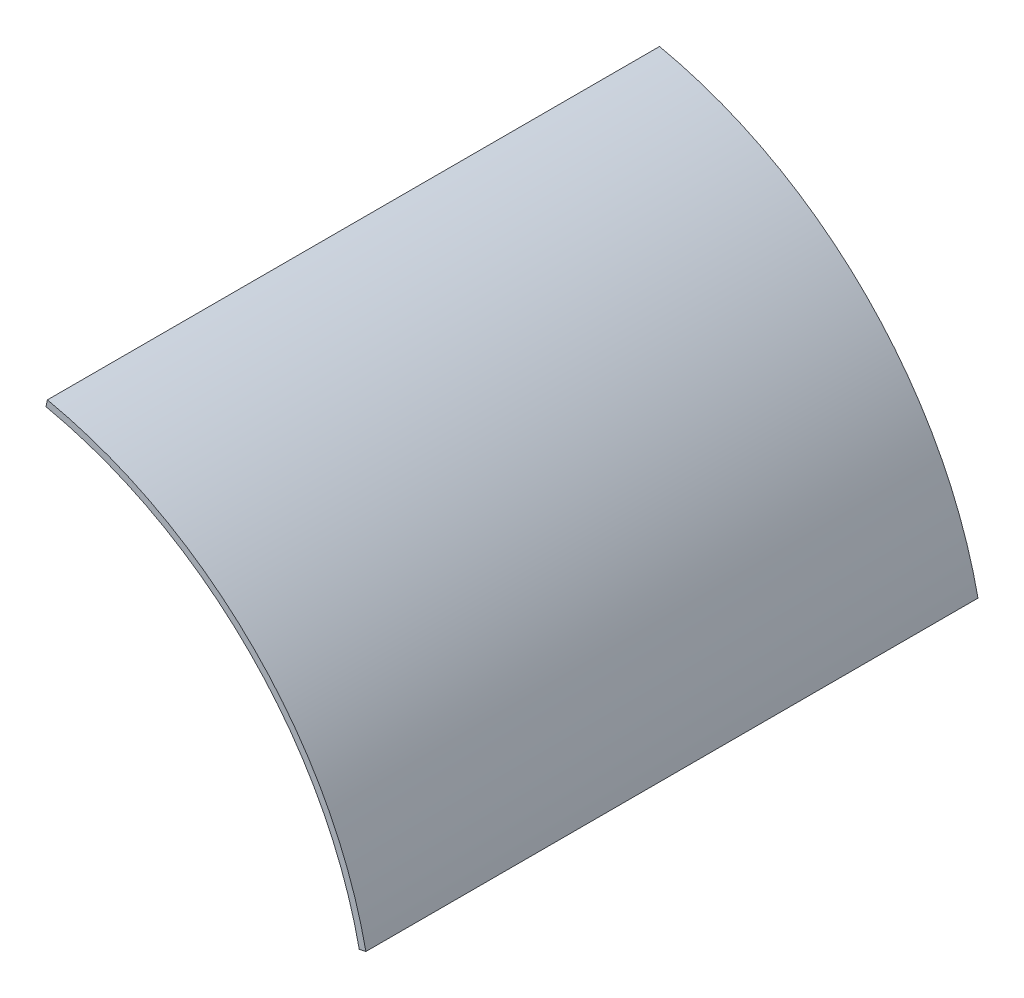
ISO-10303-21;
HEADER;
FILE_DESCRIPTION(('STEP AP214'),'2;1');
FILE_NAME('part.step','',(''),(''),'','','');
FILE_SCHEMA(('AUTOMOTIVE_DESIGN { 1 0 10303 214 1 1 1 1 }'));
ENDSEC;
DATA;
#1=APPLICATION_CONTEXT('core data for automotive mechanical design processes');
#2=APPLICATION_PROTOCOL_DEFINITION('international standard','automotive_design',2000,#1);
#3=PRODUCT_CONTEXT('',#1,'mechanical');
#4=PRODUCT('Part','Part','',(#3));
#5=PRODUCT_RELATED_PRODUCT_CATEGORY('part','',(#4));
#6=PRODUCT_DEFINITION_FORMATION('','',#4);
#7=PRODUCT_DEFINITION_CONTEXT('part definition',#1,'design');
#8=PRODUCT_DEFINITION('design','',#6,#7);
#9=PRODUCT_DEFINITION_SHAPE('','',#8);
#10=(LENGTH_UNIT() NAMED_UNIT(*) SI_UNIT(.MILLI.,.METRE.));
#11=(NAMED_UNIT(*) PLANE_ANGLE_UNIT() SI_UNIT($,.RADIAN.));
#12=(NAMED_UNIT(*) SI_UNIT($,.STERADIAN.) SOLID_ANGLE_UNIT());
#13=UNCERTAINTY_MEASURE_WITH_UNIT(LENGTH_MEASURE(1.E-05),#10,'distance_accuracy_value','');
#14=(GEOMETRIC_REPRESENTATION_CONTEXT(3) GLOBAL_UNCERTAINTY_ASSIGNED_CONTEXT((#13)) GLOBAL_UNIT_ASSIGNED_CONTEXT((#10,
#11,#12)) REPRESENTATION_CONTEXT('',''));
#15=CARTESIAN_POINT('',(0.,0.,0.));
#16=DIRECTION('',(0.,0.,1.));
#17=DIRECTION('',(1.,0.,0.));
#18=AXIS2_PLACEMENT_3D('',#15,#16,#17);
#19=CARTESIAN_POINT('',(0.,0.,45.));
#20=DIRECTION('',(0.,0.,-1.));
#21=DIRECTION('',(-1.,0.,0.));
#22=AXIS2_PLACEMENT_3D('',#19,#20,#21);
#23=CYLINDRICAL_SURFACE('',#22,30.4);
#24=CARTESIAN_POINT('',(0.,0.,0.));
#25=DIRECTION('',(0.,0.,1.));
#26=DIRECTION('',(1.,0.,0.));
#27=AXIS2_PLACEMENT_3D('',#24,#25,#26);
#28=CIRCLE('',#27,30.4);
#29=CARTESIAN_POINT('',(29.7356870623077,6.3205154008599,0.));
#30=VERTEX_POINT('',#29);
#31=CARTESIAN_POINT('',(6.3205154008599,29.7356870623077,0.));
#32=VERTEX_POINT('',#31);
#33=EDGE_CURVE('E97',#30,#32,#28,.T.);
#34=ORIENTED_EDGE('',*,*,#33,.T.);
#35=DIRECTION('',(0.,0.,-1.));
#36=VECTOR('',#35,1.);
#37=CARTESIAN_POINT('',(6.3205154008599,29.7356870623077,45.));
#38=LINE('',#37,#36);
#39=CARTESIAN_POINT('',(6.3205154008599,29.7356870623077,45.));
#40=VERTEX_POINT('',#39);
#41=EDGE_CURVE('E11',#40,#32,#38,.T.);
#42=ORIENTED_EDGE('',*,*,#41,.F.);
#43=CARTESIAN_POINT('',(0.,0.,45.));
#44=DIRECTION('',(0.,0.,1.));
#45=DIRECTION('',(1.,0.,0.));
#46=AXIS2_PLACEMENT_3D('',#43,#44,#45);
#47=CIRCLE('',#46,30.4);
#48=CARTESIAN_POINT('',(29.7356870623077,6.3205154008599,45.));
#49=VERTEX_POINT('',#48);
#50=EDGE_CURVE('E85',#49,#40,#47,.T.);
#51=ORIENTED_EDGE('',*,*,#50,.F.);
#52=DIRECTION('',(0.,0.,-1.));
#53=VECTOR('',#52,1.);
#54=CARTESIAN_POINT('',(29.7356870623077,6.3205154008599,45.));
#55=LINE('',#54,#53);
#56=EDGE_CURVE('E93',#49,#30,#55,.T.);
#57=ORIENTED_EDGE('',*,*,#56,.T.);
#58=EDGE_LOOP('',(#34,#42,#51,#57));
#59=FACE_BOUND('',#58,.T.);
#60=ADVANCED_FACE('F34',(#59),#23,.T.);
#61=CARTESIAN_POINT('',(6.3205154008599,29.7356870623077,45.));
#62=DIRECTION('',(0.978147600733805,-0.20791169081776,0.));
#63=DIRECTION('',(0.20791169081776,0.978147600733806,0.));
#64=AXIS2_PLACEMENT_3D('',#61,#62,#63);
#65=PLANE('',#64);
#66=DIRECTION('',(-0.20791169081776,-0.978147600733806,0.));
#67=VECTOR('',#66,1.);
#68=CARTESIAN_POINT('',(6.3205154008599,29.7356870623077,0.));
#69=LINE('',#68,#67);
#70=CARTESIAN_POINT('',(6.21655955545102,29.2466132619408,0.));
#71=VERTEX_POINT('',#70);
#72=EDGE_CURVE('E89',#32,#71,#69,.T.);
#73=ORIENTED_EDGE('',*,*,#72,.T.);
#74=DIRECTION('',(0.,0.,-1.));
#75=VECTOR('',#74,1.);
#76=CARTESIAN_POINT('',(6.21655955545102,29.2466132619408,45.));
#77=LINE('',#76,#75);
#78=CARTESIAN_POINT('',(6.21655955545102,29.2466132619408,45.));
#79=VERTEX_POINT('',#78);
#80=EDGE_CURVE('E42',#79,#71,#77,.T.);
#81=ORIENTED_EDGE('',*,*,#80,.F.);
#82=DIRECTION('',(-0.20791169081776,-0.978147600733806,0.));
#83=VECTOR('',#82,1.);
#84=CARTESIAN_POINT('',(6.3205154008599,29.7356870623077,45.));
#85=LINE('',#84,#83);
#86=EDGE_CURVE('E80',#40,#79,#85,.T.);
#87=ORIENTED_EDGE('',*,*,#86,.F.);
#88=ORIENTED_EDGE('',*,*,#41,.T.);
#89=EDGE_LOOP('',(#73,#81,#87,#88));
#90=FACE_BOUND('',#89,.T.);
#91=ADVANCED_FACE('F88',(#90),#65,.F.);
#92=CARTESIAN_POINT('',(0.,0.,45.));
#93=DIRECTION('',(0.,0.,-1.));
#94=DIRECTION('',(-1.,0.,0.));
#95=AXIS2_PLACEMENT_3D('',#92,#93,#94);
#96=CYLINDRICAL_SURFACE('',#95,29.9);
#97=CARTESIAN_POINT('',(0.,0.,0.));
#98=DIRECTION('',(0.,0.,-1.));
#99=DIRECTION('',(-1.,0.,0.));
#100=AXIS2_PLACEMENT_3D('',#97,#98,#99);
#101=CIRCLE('',#100,29.9);
#102=CARTESIAN_POINT('',(29.2466132619408,6.21655955545102,0.));
#103=VERTEX_POINT('',#102);
#104=EDGE_CURVE('E67',#71,#103,#101,.T.);
#105=ORIENTED_EDGE('',*,*,#104,.T.);
#106=DIRECTION('',(0.,0.,-1.));
#107=VECTOR('',#106,1.);
#108=CARTESIAN_POINT('',(29.2466132619408,6.21655955545102,45.));
#109=LINE('',#108,#107);
#110=CARTESIAN_POINT('',(29.2466132619408,6.21655955545102,45.));
#111=VERTEX_POINT('',#110);
#112=EDGE_CURVE('E90',#111,#103,#109,.T.);
#113=ORIENTED_EDGE('',*,*,#112,.F.);
#114=CARTESIAN_POINT('',(0.,0.,45.));
#115=DIRECTION('',(0.,0.,-1.));
#116=DIRECTION('',(-1.,0.,0.));
#117=AXIS2_PLACEMENT_3D('',#114,#115,#116);
#118=CIRCLE('',#117,29.9);
#119=EDGE_CURVE('E83',#79,#111,#118,.T.);
#120=ORIENTED_EDGE('',*,*,#119,.F.);
#121=ORIENTED_EDGE('',*,*,#80,.T.);
#122=EDGE_LOOP('',(#105,#113,#120,#121));
#123=FACE_BOUND('',#122,.T.);
#124=ADVANCED_FACE('F91',(#123),#96,.F.);
#125=CARTESIAN_POINT('',(29.7356870623077,6.3205154008599,45.));
#126=DIRECTION('',(-0.207911690817758,0.978147600733806,0.));
#127=DIRECTION('',(-0.978147600733806,-0.207911690817758,0.));
#128=AXIS2_PLACEMENT_3D('',#125,#126,#127);
#129=PLANE('',#128);
#130=DIRECTION('',(0.978147600733806,0.207911690817758,0.));
#131=VECTOR('',#130,1.);
#132=CARTESIAN_POINT('',(29.7356870623077,6.3205154008599,0.));
#133=LINE('',#132,#131);
#134=EDGE_CURVE('E73',#103,#30,#133,.T.);
#135=ORIENTED_EDGE('',*,*,#134,.T.);
#136=ORIENTED_EDGE('',*,*,#56,.F.);
#137=DIRECTION('',(0.978147600733806,0.207911690817758,0.));
#138=VECTOR('',#137,1.);
#139=CARTESIAN_POINT('',(29.7356870623077,6.3205154008599,45.));
#140=LINE('',#139,#138);
#141=EDGE_CURVE('E50',#111,#49,#140,.T.);
#142=ORIENTED_EDGE('',*,*,#141,.F.);
#143=ORIENTED_EDGE('',*,*,#112,.T.);
#144=EDGE_LOOP('',(#135,#136,#142,#143));
#145=FACE_BOUND('',#144,.T.);
#146=ADVANCED_FACE('F104',(#145),#129,.F.);
#147=CARTESIAN_POINT('',(0.,0.,45.));
#148=DIRECTION('',(0.,0.,1.));
#149=DIRECTION('',(1.,0.,0.));
#150=AXIS2_PLACEMENT_3D('',#147,#148,#149);
#151=PLANE('',#150);
#152=ORIENTED_EDGE('',*,*,#50,.T.);
#153=ORIENTED_EDGE('',*,*,#86,.T.);
#154=ORIENTED_EDGE('',*,*,#119,.T.);
#155=ORIENTED_EDGE('',*,*,#141,.T.);
#156=EDGE_LOOP('',(#152,#153,#154,#155));
#157=FACE_BOUND('',#156,.T.);
#158=ADVANCED_FACE('F81',(#157),#151,.T.);
#159=CARTESIAN_POINT('',(0.,0.,0.));
#160=DIRECTION('',(0.,0.,1.));
#161=DIRECTION('',(1.,0.,0.));
#162=AXIS2_PLACEMENT_3D('',#159,#160,#161);
#163=PLANE('',#162);
#164=ORIENTED_EDGE('',*,*,#33,.F.);
#165=ORIENTED_EDGE('',*,*,#134,.F.);
#166=ORIENTED_EDGE('',*,*,#104,.F.);
#167=ORIENTED_EDGE('',*,*,#72,.F.);
#168=EDGE_LOOP('',(#164,#165,#166,#167));
#169=FACE_BOUND('',#168,.T.);
#170=ADVANCED_FACE('F107',(#169),#163,.F.);
#171=CLOSED_SHELL('',(#60,#91,#124,#146,#158,#170));
#172=MANIFOLD_SOLID_BREP('B2',#171);
#173=ADVANCED_BREP_SHAPE_REPRESENTATION('',(#18,#172),#14);
#174=SHAPE_DEFINITION_REPRESENTATION(#9,#173);
ENDSEC;
END-ISO-10303-21;
